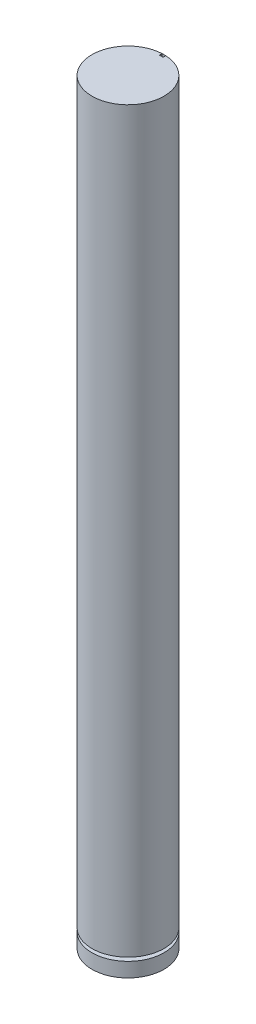
ISO-10303-21;
HEADER;
FILE_DESCRIPTION(('STEP AP214'),'2;1');
FILE_NAME('part.step','',(''),(''),'','','');
FILE_SCHEMA(('AUTOMOTIVE_DESIGN { 1 0 10303 214 1 1 1 1 }'));
ENDSEC;
DATA;
#1=APPLICATION_CONTEXT('core data for automotive mechanical design processes');
#2=APPLICATION_PROTOCOL_DEFINITION('international standard','automotive_design',2000,#1);
#3=PRODUCT_CONTEXT('',#1,'mechanical');
#4=PRODUCT('Part','Part','',(#3));
#5=PRODUCT_RELATED_PRODUCT_CATEGORY('part','',(#4));
#6=PRODUCT_DEFINITION_FORMATION('','',#4);
#7=PRODUCT_DEFINITION_CONTEXT('part definition',#1,'design');
#8=PRODUCT_DEFINITION('design','',#6,#7);
#9=PRODUCT_DEFINITION_SHAPE('','',#8);
#10=(LENGTH_UNIT() NAMED_UNIT(*) SI_UNIT(.MILLI.,.METRE.));
#11=(NAMED_UNIT(*) PLANE_ANGLE_UNIT() SI_UNIT($,.RADIAN.));
#12=(NAMED_UNIT(*) SI_UNIT($,.STERADIAN.) SOLID_ANGLE_UNIT());
#13=UNCERTAINTY_MEASURE_WITH_UNIT(LENGTH_MEASURE(1.E-05),#10,'distance_accuracy_value','');
#14=(GEOMETRIC_REPRESENTATION_CONTEXT(3) GLOBAL_UNCERTAINTY_ASSIGNED_CONTEXT((#13)) GLOBAL_UNIT_ASSIGNED_CONTEXT((#10,
#11,#12)) REPRESENTATION_CONTEXT('',''));
#15=CARTESIAN_POINT('',(0.,0.,0.));
#16=DIRECTION('',(0.,0.,1.));
#17=DIRECTION('',(1.,0.,0.));
#18=AXIS2_PLACEMENT_3D('',#15,#16,#17);
#19=CARTESIAN_POINT('',(0.,42.,0.));
#20=DIRECTION('',(0.,-1.,0.));
#21=DIRECTION('',(0.,0.,-1.));
#22=AXIS2_PLACEMENT_3D('',#19,#20,#21);
#23=CYLINDRICAL_SURFACE('',#22,2.);
#24=CARTESIAN_POINT('',(0.,1.,0.));
#25=DIRECTION('',(0.,-1.,0.));
#26=DIRECTION('',(0.,0.,-1.));
#27=AXIS2_PLACEMENT_3D('',#24,#25,#26);
#28=CIRCLE('',#27,2.);
#29=CARTESIAN_POINT('',(0.,1.,-2.));
#30=VERTEX_POINT('',#29);
#31=EDGE_CURVE('E128',#30,#30,#28,.T.);
#32=ORIENTED_EDGE('',*,*,#31,.F.);
#33=EDGE_LOOP('',(#32));
#34=FACE_BOUND('',#33,.T.);
#35=CARTESIAN_POINT('',(0.1,39.,-1.99749843554382));
#36=DIRECTION('',(-1.,0.,0.));
#37=VECTOR('',#36,1.);
#38=LINE('',#35,#37);
#39=CARTESIAN_POINT('',(0.1,39.,-1.99749843554382));
#40=VERTEX_POINT('',#39);
#41=CARTESIAN_POINT('',(-0.1,39.,-1.99749843554382));
#42=VERTEX_POINT('',#41);
#43=EDGE_CURVE('E97',#40,#42,#38,.T.);
#44=ORIENTED_EDGE('',*,*,#43,.F.);
#45=DIRECTION('',(0.,-1.,0.));
#46=VECTOR('',#45,1.);
#47=CARTESIAN_POINT('',(0.1,42.,-1.99749843554382));
#48=LINE('',#47,#46);
#49=CARTESIAN_POINT('',(0.1,42.,-1.99749843554382));
#50=VERTEX_POINT('',#49);
#51=EDGE_CURVE('E103',#40,#50,#48,.F.);
#52=ORIENTED_EDGE('',*,*,#51,.T.);
#53=CARTESIAN_POINT('',(0.,42.,0.));
#54=DIRECTION('',(0.,1.,0.));
#55=DIRECTION('',(0.,0.,1.));
#56=AXIS2_PLACEMENT_3D('',#53,#54,#55);
#57=CIRCLE('',#56,2.);
#58=CARTESIAN_POINT('',(-0.1,42.,-1.99749843554382));
#59=VERTEX_POINT('',#58);
#60=EDGE_CURVE('E110',#59,#50,#57,.T.);
#61=ORIENTED_EDGE('',*,*,#60,.F.);
#62=DIRECTION('',(0.,-1.,0.));
#63=VECTOR('',#62,1.);
#64=CARTESIAN_POINT('',(-0.0999999999999995,42.,-1.99749843554382));
#65=LINE('',#64,#63);
#66=EDGE_CURVE('E12',#42,#59,#65,.F.);
#67=ORIENTED_EDGE('',*,*,#66,.F.);
#68=EDGE_LOOP('',(#44,#52,#61,#67));
#69=FACE_BOUND('',#68,.T.);
#70=ADVANCED_FACE('F49',(#34,#69),#23,.T.);
#71=CARTESIAN_POINT('',(0.,42.,0.));
#72=DIRECTION('',(0.,1.,0.));
#73=DIRECTION('',(0.,0.,1.));
#74=AXIS2_PLACEMENT_3D('',#71,#72,#73);
#75=PLANE('',#74);
#76=DIRECTION('',(0.,0.,1.));
#77=VECTOR('',#76,1.);
#78=CARTESIAN_POINT('',(-0.1,42.,-1.99749843554382));
#79=LINE('',#78,#77);
#80=CARTESIAN_POINT('',(-0.1,42.,-1.84749843554382));
#81=VERTEX_POINT('',#80);
#82=EDGE_CURVE('E61',#59,#81,#79,.T.);
#83=ORIENTED_EDGE('',*,*,#82,.F.);
#84=ORIENTED_EDGE('',*,*,#60,.T.);
#85=DIRECTION('',(0.,0.,-1.));
#86=VECTOR('',#85,1.);
#87=CARTESIAN_POINT('',(0.1,42.,-1.99749843554382));
#88=LINE('',#87,#86);
#89=CARTESIAN_POINT('',(0.1,42.,-1.84749843554382));
#90=VERTEX_POINT('',#89);
#91=EDGE_CURVE('E106',#90,#50,#88,.T.);
#92=ORIENTED_EDGE('',*,*,#91,.F.);
#93=DIRECTION('',(1.,0.,0.));
#94=VECTOR('',#93,1.);
#95=CARTESIAN_POINT('',(-0.1,42.,-1.84749843554382));
#96=LINE('',#95,#94);
#97=EDGE_CURVE('E114',#81,#90,#96,.T.);
#98=ORIENTED_EDGE('',*,*,#97,.F.);
#99=EDGE_LOOP('',(#83,#84,#92,#98));
#100=FACE_BOUND('',#99,.T.);
#101=ADVANCED_FACE('F200',(#100),#75,.T.);
#102=CARTESIAN_POINT('',(0.,1.,-2.));
#103=DIRECTION('',(0.,1.,0.));
#104=DIRECTION('',(0.,0.,1.));
#105=AXIS2_PLACEMENT_3D('',#102,#103,#104);
#106=PLANE('',#105);
#107=CARTESIAN_POINT('',(0.,1.,0.));
#108=DIRECTION('',(0.,-1.,0.));
#109=DIRECTION('',(0.,0.,-1.));
#110=AXIS2_PLACEMENT_3D('',#107,#108,#109);
#111=CIRCLE('',#110,1.5);
#112=CARTESIAN_POINT('',(0.,1.,-1.5));
#113=VERTEX_POINT('',#112);
#114=EDGE_CURVE('E139',#113,#113,#111,.T.);
#115=ORIENTED_EDGE('',*,*,#114,.F.);
#116=EDGE_LOOP('',(#115));
#117=FACE_BOUND('',#116,.T.);
#118=ORIENTED_EDGE('',*,*,#31,.T.);
#119=EDGE_LOOP('',(#118));
#120=FACE_BOUND('',#119,.T.);
#121=ADVANCED_FACE('F196',(#117,#120),#106,.F.);
#122=CARTESIAN_POINT('',(0.,0.,0.));
#123=DIRECTION('',(0.,-1.,0.));
#124=DIRECTION('',(0.,0.,-1.));
#125=AXIS2_PLACEMENT_3D('',#122,#123,#124);
#126=CYLINDRICAL_SURFACE('',#125,1.5);
#127=CARTESIAN_POINT('',(0.,0.8,0.));
#128=DIRECTION('',(0.,-1.,0.));
#129=DIRECTION('',(0.,0.,-1.));
#130=AXIS2_PLACEMENT_3D('',#127,#128,#129);
#131=CIRCLE('',#130,1.5);
#132=CARTESIAN_POINT('',(0.,0.8,-1.5));
#133=VERTEX_POINT('',#132);
#134=EDGE_CURVE('E144',#133,#133,#131,.T.);
#135=ORIENTED_EDGE('',*,*,#134,.F.);
#136=EDGE_LOOP('',(#135));
#137=FACE_BOUND('',#136,.T.);
#138=ORIENTED_EDGE('',*,*,#114,.T.);
#139=EDGE_LOOP('',(#138));
#140=FACE_BOUND('',#139,.T.);
#141=ADVANCED_FACE('F192',(#137,#140),#126,.T.);
#142=CARTESIAN_POINT('',(0.,0.8,-2.));
#143=DIRECTION('',(0.,-1.,0.));
#144=DIRECTION('',(0.,0.,-1.));
#145=AXIS2_PLACEMENT_3D('',#142,#143,#144);
#146=PLANE('',#145);
#147=CARTESIAN_POINT('',(0.,0.8,0.));
#148=DIRECTION('',(0.,-1.,0.));
#149=DIRECTION('',(0.,0.,-1.));
#150=AXIS2_PLACEMENT_3D('',#147,#148,#149);
#151=CIRCLE('',#150,2.);
#152=CARTESIAN_POINT('',(0.,0.799999999999995,-2.));
#153=VERTEX_POINT('',#152);
#154=EDGE_CURVE('E125',#153,#153,#151,.T.);
#155=ORIENTED_EDGE('',*,*,#154,.F.);
#156=EDGE_LOOP('',(#155));
#157=FACE_BOUND('',#156,.T.);
#158=ORIENTED_EDGE('',*,*,#134,.T.);
#159=EDGE_LOOP('',(#158));
#160=FACE_BOUND('',#159,.T.);
#161=ADVANCED_FACE('F188',(#157,#160),#146,.F.);
#162=CARTESIAN_POINT('',(0.,0.,0.));
#163=DIRECTION('',(0.,1.,0.));
#164=DIRECTION('',(0.,0.,1.));
#165=AXIS2_PLACEMENT_3D('',#162,#163,#164);
#166=PLANE('',#165);
#167=CARTESIAN_POINT('',(0.,0.,0.));
#168=DIRECTION('',(0.,1.,0.));
#169=DIRECTION('',(0.,0.,1.));
#170=AXIS2_PLACEMENT_3D('',#167,#168,#169);
#171=CIRCLE('',#170,2.);
#172=CARTESIAN_POINT('',(0.,0.,-2.));
#173=VERTEX_POINT('',#172);
#174=EDGE_CURVE('E120',#173,#173,#171,.T.);
#175=ORIENTED_EDGE('',*,*,#174,.F.);
#176=EDGE_LOOP('',(#175));
#177=FACE_BOUND('',#176,.T.);
#178=ADVANCED_FACE('F191',(#177),#166,.F.);
#179=CARTESIAN_POINT('',(0.,0.799999999999995,-2.));
#180=CARTESIAN_POINT('',(0.,0.791666666666663,-2.));
#181=CARTESIAN_POINT('',(0.,0.78333333333333,-2.));
#182=CARTESIAN_POINT('',(0.,0.766666666666663,-2.));
#183=CARTESIAN_POINT('',(0.,0.758333333333328,-2.));
#184=CARTESIAN_POINT('',(0.,0.741666666666661,-2.));
#185=CARTESIAN_POINT('',(0.,0.733333333333329,-2.));
#186=CARTESIAN_POINT('',(0.,0.716666666666662,-2.));
#187=CARTESIAN_POINT('',(0.,0.708333333333327,-2.));
#188=CARTESIAN_POINT('',(0.,0.69166666666666,-2.));
#189=CARTESIAN_POINT('',(0.,0.683333333333327,-2.));
#190=CARTESIAN_POINT('',(0.,0.666666666666663,-2.));
#191=CARTESIAN_POINT('',(0.,0.65833333333333,-2.));
#192=CARTESIAN_POINT('',(0.,0.641666666666663,-2.));
#193=CARTESIAN_POINT('',(0.,0.633333333333328,-2.));
#194=CARTESIAN_POINT('',(0.,0.616666666666661,-2.));
#195=CARTESIAN_POINT('',(0.,0.608333333333329,-2.));
#196=CARTESIAN_POINT('',(0.,0.591666666666664,-2.));
#197=CARTESIAN_POINT('',(0.,0.583333333333331,-2.));
#198=CARTESIAN_POINT('',(0.,0.566666666666664,-2.));
#199=CARTESIAN_POINT('',(0.,0.55833333333333,-2.));
#200=CARTESIAN_POINT('',(0.,0.541666666666663,-2.));
#201=CARTESIAN_POINT('',(0.,0.53333333333333,-2.));
#202=CARTESIAN_POINT('',(0.,0.516666666666665,-2.));
#203=CARTESIAN_POINT('',(0.,0.508333333333333,-2.));
#204=CARTESIAN_POINT('',(0.,0.491666666666666,-2.));
#205=CARTESIAN_POINT('',(0.,0.483333333333331,-2.));
#206=CARTESIAN_POINT('',(0.,0.466666666666664,-2.));
#207=CARTESIAN_POINT('',(0.,0.458333333333331,-2.));
#208=CARTESIAN_POINT('',(0.,0.441666666666664,-2.));
#209=CARTESIAN_POINT('',(0.,0.43333333333333,-2.));
#210=CARTESIAN_POINT('',(0.,0.416666666666662,-2.));
#211=CARTESIAN_POINT('',(0.,0.40833333333333,-2.));
#212=CARTESIAN_POINT('',(0.,0.391666666666665,-2.));
#213=CARTESIAN_POINT('',(0.,0.383333333333333,-2.));
#214=CARTESIAN_POINT('',(0.,0.366666666666666,-2.));
#215=CARTESIAN_POINT('',(0.,0.358333333333331,-2.));
#216=CARTESIAN_POINT('',(0.,0.341666666666664,-2.));
#217=CARTESIAN_POINT('',(0.,0.333333333333331,-2.));
#218=CARTESIAN_POINT('',(0.,0.316666666666664,-2.));
#219=CARTESIAN_POINT('',(0.,0.308333333333329,-2.));
#220=CARTESIAN_POINT('',(0.,0.291666666666662,-2.));
#221=CARTESIAN_POINT('',(0.,0.28333333333333,-2.));
#222=CARTESIAN_POINT('',(0.,0.266666666666665,-2.));
#223=CARTESIAN_POINT('',(0.,0.258333333333333,-2.));
#224=CARTESIAN_POINT('',(0.,0.241666666666666,-2.));
#225=CARTESIAN_POINT('',(0.,0.233333333333331,-2.));
#226=CARTESIAN_POINT('',(0.,0.216666666666664,-2.));
#227=CARTESIAN_POINT('',(0.,0.208333333333331,-2.));
#228=CARTESIAN_POINT('',(0.,0.191666666666666,-2.));
#229=CARTESIAN_POINT('',(0.,0.183333333333334,-2.));
#230=CARTESIAN_POINT('',(0.,0.166666666666667,-2.));
#231=CARTESIAN_POINT('',(0.,0.158333333333332,-2.));
#232=CARTESIAN_POINT('',(0.,0.141666666666665,-2.));
#233=CARTESIAN_POINT('',(0.,0.133333333333333,-2.));
#234=CARTESIAN_POINT('',(0.,0.116666666666668,-2.));
#235=CARTESIAN_POINT('',(0.,0.108333333333335,-2.));
#236=CARTESIAN_POINT('',(0.,0.0916666666666681,-2.));
#237=CARTESIAN_POINT('',(0.,0.0833333333333334,-2.));
#238=CARTESIAN_POINT('',(0.,0.0666666666666663,-2.));
#239=CARTESIAN_POINT('',(0.,0.0583333333333338,-2.));
#240=CARTESIAN_POINT('',(0.,0.0416666666666667,-2.));
#241=CARTESIAN_POINT('',(0.,0.033333333333332,-2.));
#242=CARTESIAN_POINT('',(0.,0.0166666666666648,-2.));
#243=CARTESIAN_POINT('',(0.,0.0083333333333324,-2.));
#244=CARTESIAN_POINT('',(0.,0.,-2.));
#245=B_SPLINE_CURVE_WITH_KNOTS('',3,(#179,#180,#181,#182,#183,#184,#185,#186,#187,#188,#189,
#190,#191,#192,#193,#194,#195,#196,#197,#198,#199,#200,#201,#202,#203,#204,#205,#206,#207,#208,
#209,#210,#211,#212,#213,#214,#215,#216,#217,#218,#219,#220,#221,#222,#223,#224,#225,#226,#227,
#228,#229,#230,#231,#232,#233,#234,#235,#236,#237,#238,#239,#240,#241,#242,#243,#244),
.UNSPECIFIED.,.F.,.F.,(4,2,2,2,2,2,2,2,2,2,2,2,2,2,2,2,2,2,2,2,2,2,2,2,2,2,2,2,2,2,2,2,4),(0.,
0.0249999999999972,0.0500000000000014,0.0749999999999987,0.100000000000003,0.125,
0.149999999999997,0.175000000000002,0.199999999999999,0.224999999999996,0.25,0.274999999999997,
0.299999999999995,0.324999999999999,0.349999999999996,0.375,0.399999999999998,0.424999999999995,
0.449999999999999,0.474999999999996,0.5,0.524999999999998,0.549999999999995,0.574999999999999,
0.599999999999996,0.624999999999994,0.649999999999998,0.674999999999995,0.699999999999992,
0.724999999999997,0.749999999999994,0.774999999999998,0.799999999999995),.UNSPECIFIED.);
#246=EDGE_CURVE('BSEAM51',#153,#173,#245,.T.);
#247=ORIENTED_EDGE('',*,*,#154,.T.);
#248=ORIENTED_EDGE('',*,*,#174,.T.);
#249=ORIENTED_EDGE('',*,*,#246,.T.);
#250=ORIENTED_EDGE('',*,*,#246,.F.);
#251=EDGE_LOOP('',(#247,#249,#248,#250));
#252=FACE_BOUND('',#251,.T.);
#253=ADVANCED_FACE('F51',(#252),#23,.T.);
#254=CARTESIAN_POINT('',(0.,39.,0.));
#255=DIRECTION('',(0.,1.,0.));
#256=DIRECTION('',(0.,0.,1.));
#257=AXIS2_PLACEMENT_3D('',#254,#255,#256);
#258=PLANE('',#257);
#259=DIRECTION('',(0.,0.,1.));
#260=VECTOR('',#259,1.);
#261=CARTESIAN_POINT('',(-0.1,39.,-1.99749843554382));
#262=LINE('',#261,#260);
#263=CARTESIAN_POINT('',(-0.1,39.,-1.84749843554382));
#264=VERTEX_POINT('',#263);
#265=EDGE_CURVE('E124',#42,#264,#262,.T.);
#266=ORIENTED_EDGE('',*,*,#265,.T.);
#267=DIRECTION('',(1.,0.,0.));
#268=VECTOR('',#267,1.);
#269=CARTESIAN_POINT('',(-0.1,39.,-1.84749843554382));
#270=LINE('',#269,#268);
#271=CARTESIAN_POINT('',(0.1,39.,-1.84749843554382));
#272=VERTEX_POINT('',#271);
#273=EDGE_CURVE('E54',#264,#272,#270,.T.);
#274=ORIENTED_EDGE('',*,*,#273,.T.);
#275=DIRECTION('',(0.,0.,-1.));
#276=VECTOR('',#275,1.);
#277=CARTESIAN_POINT('',(0.1,39.,-1.99749843554382));
#278=LINE('',#277,#276);
#279=EDGE_CURVE('E92',#272,#40,#278,.T.);
#280=ORIENTED_EDGE('',*,*,#279,.T.);
#281=ORIENTED_EDGE('',*,*,#43,.T.);
#282=EDGE_LOOP('',(#266,#274,#280,#281));
#283=FACE_BOUND('',#282,.T.);
#284=ADVANCED_FACE('F95',(#283),#258,.T.);
#285=CARTESIAN_POINT('',(-0.1,39.,-1.84749843554382));
#286=DIRECTION('',(0.,0.,1.));
#287=DIRECTION('',(1.,0.,0.));
#288=AXIS2_PLACEMENT_3D('',#285,#286,#287);
#289=PLANE('',#288);
#290=ORIENTED_EDGE('',*,*,#97,.T.);
#291=DIRECTION('',(0.,1.,0.));
#292=VECTOR('',#291,1.);
#293=CARTESIAN_POINT('',(0.1,39.,-1.84749843554382));
#294=LINE('',#293,#292);
#295=EDGE_CURVE('E86',#272,#90,#294,.T.);
#296=ORIENTED_EDGE('',*,*,#295,.F.);
#297=ORIENTED_EDGE('',*,*,#273,.F.);
#298=DIRECTION('',(0.,1.,0.));
#299=VECTOR('',#298,1.);
#300=CARTESIAN_POINT('',(-0.1,39.,-1.84749843554382));
#301=LINE('',#300,#299);
#302=EDGE_CURVE('E162',#264,#81,#301,.T.);
#303=ORIENTED_EDGE('',*,*,#302,.T.);
#304=EDGE_LOOP('',(#290,#296,#297,#303));
#305=FACE_BOUND('',#304,.T.);
#306=ADVANCED_FACE('F180',(#305),#289,.F.);
#307=CARTESIAN_POINT('',(0.1,39.,-1.99749843554382));
#308=DIRECTION('',(1.,0.,0.));
#309=DIRECTION('',(0.,0.,-1.));
#310=AXIS2_PLACEMENT_3D('',#307,#308,#309);
#311=PLANE('',#310);
#312=ORIENTED_EDGE('',*,*,#91,.T.);
#313=ORIENTED_EDGE('',*,*,#51,.F.);
#314=ORIENTED_EDGE('',*,*,#279,.F.);
#315=ORIENTED_EDGE('',*,*,#295,.T.);
#316=EDGE_LOOP('',(#312,#313,#314,#315));
#317=FACE_BOUND('',#316,.T.);
#318=ADVANCED_FACE('F104',(#317),#311,.F.);
#319=CARTESIAN_POINT('',(-0.1,39.,-1.99749843554382));
#320=DIRECTION('',(-1.,0.,0.));
#321=DIRECTION('',(0.,0.,1.));
#322=AXIS2_PLACEMENT_3D('',#319,#320,#321);
#323=PLANE('',#322);
#324=ORIENTED_EDGE('',*,*,#82,.T.);
#325=ORIENTED_EDGE('',*,*,#302,.F.);
#326=ORIENTED_EDGE('',*,*,#265,.F.);
#327=ORIENTED_EDGE('',*,*,#66,.T.);
#328=EDGE_LOOP('',(#324,#325,#326,#327));
#329=FACE_BOUND('',#328,.T.);
#330=ADVANCED_FACE('F183',(#329),#323,.F.);
#331=CLOSED_SHELL('',(#70,#101,#121,#141,#161,#178,#253,#284,#306,#318,#330));
#332=MANIFOLD_SOLID_BREP('B2',#331);
#333=CARTESIAN_POINT('',(0.,42.,0.));
#334=DIRECTION('',(0.,-1.,0.));
#335=DIRECTION('',(0.,0.,-1.));
#336=AXIS2_PLACEMENT_3D('',#333,#334,#335);
#337=CYLINDRICAL_SURFACE('',#336,2.);
#338=DIRECTION('',(0.,1.,0.));
#339=VECTOR('',#338,1.);
#340=CARTESIAN_POINT('',(0.1,39.,-1.99749843554382));
#341=LINE('',#340,#339);
#342=CARTESIAN_POINT('',(0.1,39.,-1.99749843554382));
#343=VERTEX_POINT('',#342);
#344=CARTESIAN_POINT('',(0.1,42.,-1.99749843554382));
#345=VERTEX_POINT('',#344);
#346=EDGE_CURVE('E307',#343,#345,#341,.T.);
#347=ORIENTED_EDGE('',*,*,#346,.F.);
#348=CARTESIAN_POINT('',(0.,39.,0.));
#349=DIRECTION('',(0.,1.,0.));
#350=DIRECTION('',(0.05,0.,-0.998749217771909));
#351=AXIS2_PLACEMENT_3D('',#348,#349,#350);
#352=CIRCLE('',#351,2.);
#353=CARTESIAN_POINT('',(-0.1,39.,-1.99749843554382));
#354=VERTEX_POINT('',#353);
#355=EDGE_CURVE('E326',#343,#354,#352,.T.);
#356=ORIENTED_EDGE('',*,*,#355,.T.);
#357=DIRECTION('',(0.,1.,0.));
#358=VECTOR('',#357,1.);
#359=CARTESIAN_POINT('',(-0.1,39.,-1.99749843554382));
#360=LINE('',#359,#358);
#361=CARTESIAN_POINT('',(-0.1,42.,-1.99749843554382));
#362=VERTEX_POINT('',#361);
#363=EDGE_CURVE('E47',#354,#362,#360,.T.);
#364=ORIENTED_EDGE('',*,*,#363,.T.);
#365=CARTESIAN_POINT('',(0.1,42.,-1.99749843554382));
#366=DIRECTION('',(-1.,0.,0.));
#367=VECTOR('',#366,1.);
#368=LINE('',#365,#367);
#369=EDGE_CURVE('E322',#345,#362,#368,.T.);
#370=ORIENTED_EDGE('',*,*,#369,.F.);
#371=EDGE_LOOP('',(#347,#356,#364,#370));
#372=FACE_BOUND('',#371,.T.);
#373=ADVANCED_FACE('F297',(#372),#337,.T.);
#374=CARTESIAN_POINT('',(-0.1,39.,-1.99749843554382));
#375=DIRECTION('',(0.,0.,-1.));
#376=DIRECTION('',(-1.,0.,0.));
#377=AXIS2_PLACEMENT_3D('',#374,#375,#376);
#378=PLANE('',#377);
#379=ORIENTED_EDGE('',*,*,#369,.T.);
#380=ORIENTED_EDGE('',*,*,#363,.F.);
#381=ORIENTED_EDGE('',*,*,#355,.F.);
#382=ORIENTED_EDGE('',*,*,#346,.T.);
#383=EDGE_LOOP('',(#379,#380,#381,#382));
#384=FACE_BOUND('',#383,.T.);
#385=ADVANCED_FACE('F324',(#384),#378,.F.);
#386=CLOSED_SHELL('',(#373,#385));
#387=MANIFOLD_SOLID_BREP('B6',#386);
#388=ADVANCED_BREP_SHAPE_REPRESENTATION('',(#18,#332,#387),#14);
#389=SHAPE_DEFINITION_REPRESENTATION(#9,#388);
ENDSEC;
END-ISO-10303-21;
